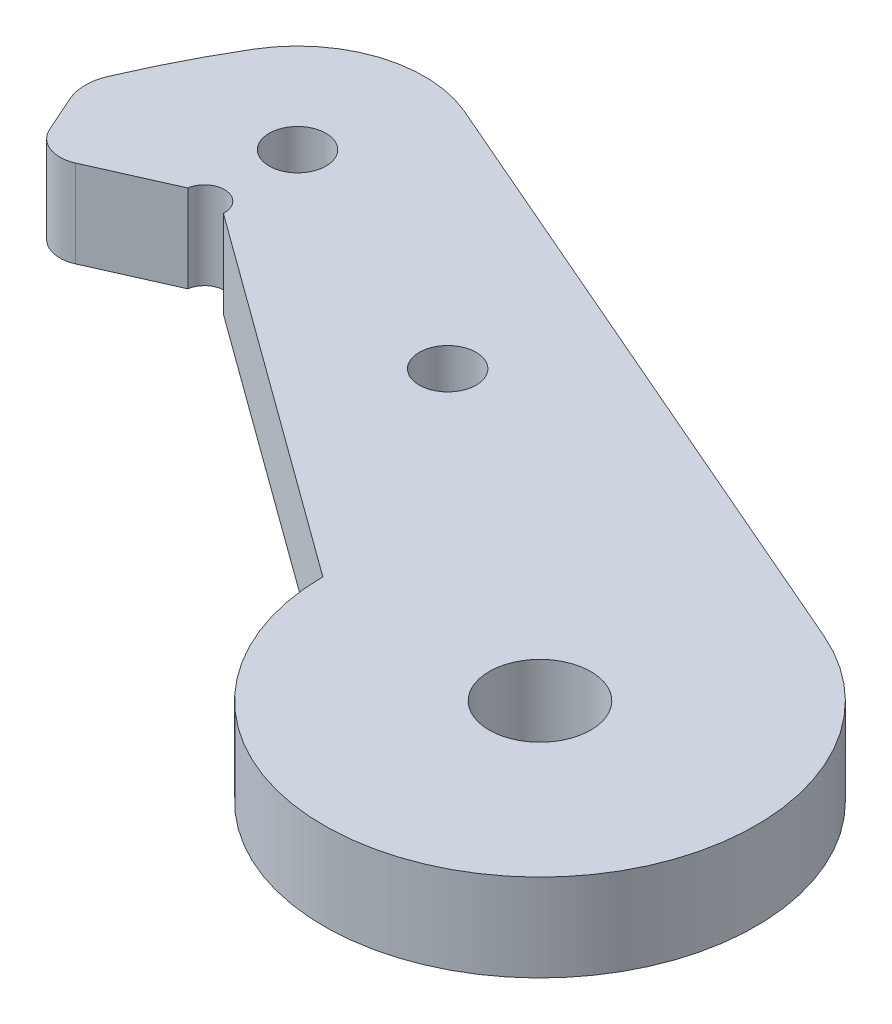
ISO-10303-21;
HEADER;
FILE_DESCRIPTION(('STEP AP214'),'2;1');
FILE_NAME('part.step','',(''),(''),'','','');
FILE_SCHEMA(('AUTOMOTIVE_DESIGN { 1 0 10303 214 1 1 1 1 }'));
ENDSEC;
DATA;
#1=APPLICATION_CONTEXT('core data for automotive mechanical design processes');
#2=APPLICATION_PROTOCOL_DEFINITION('international standard','automotive_design',2000,#1);
#3=PRODUCT_CONTEXT('',#1,'mechanical');
#4=PRODUCT('Part','Part','',(#3));
#5=PRODUCT_RELATED_PRODUCT_CATEGORY('part','',(#4));
#6=PRODUCT_DEFINITION_FORMATION('','',#4);
#7=PRODUCT_DEFINITION_CONTEXT('part definition',#1,'design');
#8=PRODUCT_DEFINITION('design','',#6,#7);
#9=PRODUCT_DEFINITION_SHAPE('','',#8);
#10=(LENGTH_UNIT() NAMED_UNIT(*) SI_UNIT(.MILLI.,.METRE.));
#11=(NAMED_UNIT(*) PLANE_ANGLE_UNIT() SI_UNIT($,.RADIAN.));
#12=(NAMED_UNIT(*) SI_UNIT($,.STERADIAN.) SOLID_ANGLE_UNIT());
#13=UNCERTAINTY_MEASURE_WITH_UNIT(LENGTH_MEASURE(1.E-05),#10,'distance_accuracy_value','');
#14=(GEOMETRIC_REPRESENTATION_CONTEXT(3) GLOBAL_UNCERTAINTY_ASSIGNED_CONTEXT((#13)) GLOBAL_UNIT_ASSIGNED_CONTEXT((#10,
#11,#12)) REPRESENTATION_CONTEXT('',''));
#15=CARTESIAN_POINT('',(0.,0.,0.));
#16=DIRECTION('',(0.,0.,1.));
#17=DIRECTION('',(1.,0.,0.));
#18=AXIS2_PLACEMENT_3D('',#15,#16,#17);
#19=CARTESIAN_POINT('',(-44.4381463641511,5.461,-16.4261833639371));
#20=DIRECTION('',(0.,-1.,0.));
#21=DIRECTION('',(0.,0.,-1.));
#22=AXIS2_PLACEMENT_3D('',#19,#20,#21);
#23=PLANE('',#22);
#24=CARTESIAN_POINT('',(-44.4381463641511,5.461,-16.4261833639371));
#25=DIRECTION('',(0.,1.,0.));
#26=DIRECTION('',(0.,0.,-1.));
#27=AXIS2_PLACEMENT_3D('',#24,#25,#26);
#28=CIRCLE('',#27,2.);
#29=CARTESIAN_POINT('',(-46.2655823530906,5.461,-15.6134855687334));
#30=VERTEX_POINT('',#29);
#31=CARTESIAN_POINT('',(-43.6254485689475,5.461,-14.5987473749976));
#32=VERTEX_POINT('',#31);
#33=EDGE_CURVE('E177',#30,#32,#28,.T.);
#34=ORIENTED_EDGE('',*,*,#33,.T.);
#35=DIRECTION('',(0.913717994469729,0.,-0.406348897601823));
#36=VECTOR('',#35,1.);
#37=CARTESIAN_POINT('',(-38.7702250311405,5.461,-16.7579636147339));
#38=LINE('',#37,#36);
#39=CARTESIAN_POINT('',(-38.7702250311405,5.461,-16.7579636147339));
#40=VERTEX_POINT('',#39);
#41=EDGE_CURVE('E109',#32,#40,#38,.T.);
#42=ORIENTED_EDGE('',*,*,#41,.T.);
#43=CARTESIAN_POINT('',(-37.5347907026087,5.461,-16.5676953307629));
#44=DIRECTION('',(0.,-1.,0.));
#45=DIRECTION('',(0.,0.,-1.));
#46=AXIS2_PLACEMENT_3D('',#43,#44,#45);
#47=CIRCLE('',#46,1.25);
#48=CARTESIAN_POINT('',(-36.2868550805044,5.461,-16.4958852821415));
#49=VERTEX_POINT('',#48);
#50=EDGE_CURVE('E194',#40,#49,#47,.T.);
#51=ORIENTED_EDGE('',*,*,#50,.T.);
#52=DIRECTION('',(0.808767465357847,0.,0.588128546304839));
#53=VECTOR('',#52,1.);
#54=CARTESIAN_POINT('',(-36.2868550805044,5.461,-16.4958852821415));
#55=LINE('',#54,#53);
#56=CARTESIAN_POINT('',(-13.4997935259034,5.461,0.074664301893318));
#57=VERTEX_POINT('',#56);
#58=EDGE_CURVE('E197',#49,#57,#55,.T.);
#59=ORIENTED_EDGE('',*,*,#58,.T.);
#60=CARTESIAN_POINT('',(0.,5.461,0.));
#61=DIRECTION('',(0.,1.,0.));
#62=DIRECTION('',(0.,0.,1.));
#63=AXIS2_PLACEMENT_3D('',#60,#61,#62);
#64=CIRCLE('',#63,13.5);
#65=CARTESIAN_POINT('',(5.36363887672502,5.461,-12.3887601478148));
#66=VERTEX_POINT('',#65);
#67=EDGE_CURVE('E201',#57,#66,#64,.T.);
#68=ORIENTED_EDGE('',*,*,#67,.T.);
#69=DIRECTION('',(-0.917685936875169,0.,-0.397306583461113));
#70=VECTOR('',#69,1.);
#71=CARTESIAN_POINT('',(-34.2596328863461,5.461,-29.5434163293646));
#72=LINE('',#71,#70);
#73=CARTESIAN_POINT('',(-34.2596328863461,5.461,-29.5434163293646));
#74=VERTEX_POINT('',#73);
#75=EDGE_CURVE('E205',#66,#74,#72,.T.);
#76=ORIENTED_EDGE('',*,*,#75,.T.);
#77=CARTESIAN_POINT('',(-37.4132538925687,5.461,-22.2592842054179));
#78=DIRECTION('',(0.,1.,0.));
#79=DIRECTION('',(0.,0.,1.));
#80=AXIS2_PLACEMENT_3D('',#77,#78,#79);
#81=CIRCLE('',#80,7.93750000000001);
#82=CARTESIAN_POINT('',(-44.234733224639,5.461,-26.3177723441387));
#83=VERTEX_POINT('',#82);
#84=EDGE_CURVE('E134',#74,#83,#81,.T.);
#85=ORIENTED_EDGE('',*,*,#84,.T.);
#86=CARTESIAN_POINT('',(0.,5.461,0.));
#87=DIRECTION('',(0.,1.,0.));
#88=DIRECTION('',(0.,0.,-1.));
#89=AXIS2_PLACEMENT_3D('',#86,#87,#88);
#90=CIRCLE('',#89,51.4717083902691);
#91=CARTESIAN_POINT('',(-47.2982832858306,5.461,-20.3029348328316));
#92=VERTEX_POINT('',#91);
#93=EDGE_CURVE('E128',#83,#92,#90,.T.);
#94=ORIENTED_EDGE('',*,*,#93,.T.);
#95=CARTESIAN_POINT('',(-44.5415290553004,5.461,-19.1195895271606));
#96=DIRECTION('',(0.,1.,0.));
#97=DIRECTION('',(0.,0.,1.));
#98=AXIS2_PLACEMENT_3D('',#95,#96,#97);
#99=CIRCLE('',#98,3.);
#100=CARTESIAN_POINT('',(-47.2826830387096,5.461,-17.9005428343551));
#101=VERTEX_POINT('',#100);
#102=EDGE_CURVE('E132',#92,#101,#99,.T.);
#103=ORIENTED_EDGE('',*,*,#102,.T.);
#104=DIRECTION('',(0.406348897601824,0.,0.913717994469728));
#105=VECTOR('',#104,1.);
#106=CARTESIAN_POINT('',(-46.2655823530906,5.461,-15.6134855687334));
#107=LINE('',#106,#105);
#108=EDGE_CURVE('E60',#101,#30,#107,.T.);
#109=ORIENTED_EDGE('',*,*,#108,.T.);
#110=EDGE_LOOP('',(#34,#42,#51,#59,#68,#76,#85,#94,#103,#109));
#111=FACE_BOUND('',#110,.T.);
#112=CARTESIAN_POINT('',(-20.8624589223986,5.461,-15.0937174914343));
#113=DIRECTION('',(0.,1.,0.));
#114=DIRECTION('',(0.,0.,1.));
#115=AXIS2_PLACEMENT_3D('',#112,#113,#114);
#116=CIRCLE('',#115,1.778);
#117=CARTESIAN_POINT('',(-20.8624589223986,5.461,-13.3157174914343));
#118=VERTEX_POINT('',#117);
#119=EDGE_CURVE('E165',#118,#118,#116,.T.);
#120=ORIENTED_EDGE('',*,*,#119,.F.);
#121=EDGE_LOOP('',(#120));
#122=FACE_BOUND('',#121,.T.);
#123=CARTESIAN_POINT('',(0.,5.461,0.));
#124=DIRECTION('',(0.,1.,0.));
#125=DIRECTION('',(0.,0.,1.));
#126=AXIS2_PLACEMENT_3D('',#123,#124,#125);
#127=CIRCLE('',#126,3.175);
#128=CARTESIAN_POINT('',(0.,5.461,3.175));
#129=VERTEX_POINT('',#128);
#130=EDGE_CURVE('E176',#129,#129,#127,.T.);
#131=ORIENTED_EDGE('',*,*,#130,.F.);
#132=EDGE_LOOP('',(#131));
#133=FACE_BOUND('',#132,.T.);
#134=CARTESIAN_POINT('',(-37.4132538925687,5.461,-22.2592842054179));
#135=DIRECTION('',(0.,1.,0.));
#136=DIRECTION('',(0.,0.,1.));
#137=AXIS2_PLACEMENT_3D('',#134,#135,#136);
#138=CIRCLE('',#137,1.778);
#139=CARTESIAN_POINT('',(-37.4132538925687,5.461,-20.4812842054179));
#140=VERTEX_POINT('',#139);
#141=EDGE_CURVE('E404',#140,#140,#138,.T.);
#142=ORIENTED_EDGE('',*,*,#141,.F.);
#143=EDGE_LOOP('',(#142));
#144=FACE_BOUND('',#143,.T.);
#145=ADVANCED_FACE('F43',(#111,#122,#133,#144),#23,.F.);
#146=CARTESIAN_POINT('',(-44.4381463641511,0.,-16.4261833639371));
#147=DIRECTION('',(0.,-1.,0.));
#148=DIRECTION('',(0.,0.,-1.));
#149=AXIS2_PLACEMENT_3D('',#146,#147,#148);
#150=PLANE('',#149);
#151=CARTESIAN_POINT('',(0.,0.,0.));
#152=DIRECTION('',(0.,1.,0.));
#153=DIRECTION('',(0.,0.,1.));
#154=AXIS2_PLACEMENT_3D('',#151,#152,#153);
#155=CIRCLE('',#154,3.175);
#156=CARTESIAN_POINT('',(0.,0.,3.175));
#157=VERTEX_POINT('',#156);
#158=EDGE_CURVE('E173',#157,#157,#155,.T.);
#159=ORIENTED_EDGE('',*,*,#158,.T.);
#160=EDGE_LOOP('',(#159));
#161=FACE_BOUND('',#160,.T.);
#162=CARTESIAN_POINT('',(-44.4381463641511,0.,-16.4261833639371));
#163=DIRECTION('',(0.,1.,0.));
#164=DIRECTION('',(0.,0.,-1.));
#165=AXIS2_PLACEMENT_3D('',#162,#163,#164);
#166=CIRCLE('',#165,2.);
#167=CARTESIAN_POINT('',(-46.2655823530906,0.,-15.6134855687334));
#168=VERTEX_POINT('',#167);
#169=CARTESIAN_POINT('',(-43.6254485689475,0.,-14.5987473749976));
#170=VERTEX_POINT('',#169);
#171=EDGE_CURVE('E171',#168,#170,#166,.T.);
#172=ORIENTED_EDGE('',*,*,#171,.F.);
#173=DIRECTION('',(0.406348897601824,0.,0.913717994469728));
#174=VECTOR('',#173,1.);
#175=CARTESIAN_POINT('',(-46.2655823530906,0.,-15.6134855687334));
#176=LINE('',#175,#174);
#177=CARTESIAN_POINT('',(-47.2826830387096,0.,-17.9005428343551));
#178=VERTEX_POINT('',#177);
#179=EDGE_CURVE('E101',#178,#168,#176,.T.);
#180=ORIENTED_EDGE('',*,*,#179,.F.);
#181=CARTESIAN_POINT('',(-44.5415290553004,0.,-19.1195895271606));
#182=DIRECTION('',(0.,1.,0.));
#183=DIRECTION('',(0.,0.,1.));
#184=AXIS2_PLACEMENT_3D('',#181,#182,#183);
#185=CIRCLE('',#184,3.);
#186=CARTESIAN_POINT('',(-47.2982832858306,0.,-20.3029348328316));
#187=VERTEX_POINT('',#186);
#188=EDGE_CURVE('E95',#187,#178,#185,.T.);
#189=ORIENTED_EDGE('',*,*,#188,.F.);
#190=CARTESIAN_POINT('',(0.,0.,0.));
#191=DIRECTION('',(0.,1.,0.));
#192=DIRECTION('',(0.,0.,-1.));
#193=AXIS2_PLACEMENT_3D('',#190,#191,#192);
#194=CIRCLE('',#193,51.4717083902691);
#195=CARTESIAN_POINT('',(-44.234733224639,0.,-26.3177723441387));
#196=VERTEX_POINT('',#195);
#197=EDGE_CURVE('E143',#196,#187,#194,.T.);
#198=ORIENTED_EDGE('',*,*,#197,.F.);
#199=CARTESIAN_POINT('',(-37.4132538925687,0.,-22.2592842054179));
#200=DIRECTION('',(0.,1.,0.));
#201=DIRECTION('',(0.,0.,1.));
#202=AXIS2_PLACEMENT_3D('',#199,#200,#201);
#203=CIRCLE('',#202,7.93750000000001);
#204=CARTESIAN_POINT('',(-34.2596328863461,0.,-29.5434163293646));
#205=VERTEX_POINT('',#204);
#206=EDGE_CURVE('E227',#205,#196,#203,.T.);
#207=ORIENTED_EDGE('',*,*,#206,.F.);
#208=DIRECTION('',(-0.917685936875169,0.,-0.397306583461113));
#209=VECTOR('',#208,1.);
#210=CARTESIAN_POINT('',(-34.2596328863461,0.,-29.5434163293646));
#211=LINE('',#210,#209);
#212=CARTESIAN_POINT('',(5.36363887672502,0.,-12.3887601478148));
#213=VERTEX_POINT('',#212);
#214=EDGE_CURVE('E221',#213,#205,#211,.T.);
#215=ORIENTED_EDGE('',*,*,#214,.F.);
#216=CARTESIAN_POINT('',(0.,0.,0.));
#217=DIRECTION('',(0.,1.,0.));
#218=DIRECTION('',(0.,0.,1.));
#219=AXIS2_PLACEMENT_3D('',#216,#217,#218);
#220=CIRCLE('',#219,13.5);
#221=CARTESIAN_POINT('',(-13.4997935259034,0.,0.074664301893318));
#222=VERTEX_POINT('',#221);
#223=EDGE_CURVE('E253',#222,#213,#220,.T.);
#224=ORIENTED_EDGE('',*,*,#223,.F.);
#225=DIRECTION('',(0.808767465357847,0.,0.588128546304839));
#226=VECTOR('',#225,1.);
#227=CARTESIAN_POINT('',(-36.2868550805044,0.,-16.4958852821415));
#228=LINE('',#227,#226);
#229=CARTESIAN_POINT('',(-36.2868550805044,0.,-16.4958852821415));
#230=VERTEX_POINT('',#229);
#231=EDGE_CURVE('E251',#230,#222,#228,.T.);
#232=ORIENTED_EDGE('',*,*,#231,.F.);
#233=CARTESIAN_POINT('',(-37.5347907026087,0.,-16.5676953307629));
#234=DIRECTION('',(0.,-1.,0.));
#235=DIRECTION('',(0.,0.,-1.));
#236=AXIS2_PLACEMENT_3D('',#233,#234,#235);
#237=CIRCLE('',#236,1.25);
#238=CARTESIAN_POINT('',(-38.7702250311405,0.,-16.7579636147339));
#239=VERTEX_POINT('',#238);
#240=EDGE_CURVE('E243',#239,#230,#237,.T.);
#241=ORIENTED_EDGE('',*,*,#240,.F.);
#242=DIRECTION('',(0.913717994469729,0.,-0.406348897601823));
#243=VECTOR('',#242,1.);
#244=CARTESIAN_POINT('',(-38.7702250311405,0.,-16.7579636147339));
#245=LINE('',#244,#243);
#246=EDGE_CURVE('E249',#170,#239,#245,.T.);
#247=ORIENTED_EDGE('',*,*,#246,.F.);
#248=EDGE_LOOP('',(#172,#180,#189,#198,#207,#215,#224,#232,#241,#247));
#249=FACE_BOUND('',#248,.T.);
#250=CARTESIAN_POINT('',(-20.8624589223986,0.,-15.0937174914343));
#251=DIRECTION('',(0.,1.,0.));
#252=DIRECTION('',(0.,0.,1.));
#253=AXIS2_PLACEMENT_3D('',#250,#251,#252);
#254=CIRCLE('',#253,1.778);
#255=CARTESIAN_POINT('',(-20.8624589223986,0.,-13.3157174914343));
#256=VERTEX_POINT('',#255);
#257=EDGE_CURVE('E172',#256,#256,#254,.T.);
#258=ORIENTED_EDGE('',*,*,#257,.T.);
#259=EDGE_LOOP('',(#258));
#260=FACE_BOUND('',#259,.T.);
#261=CARTESIAN_POINT('',(-37.4132538925687,0.,-22.2592842054179));
#262=DIRECTION('',(0.,1.,0.));
#263=DIRECTION('',(0.,0.,1.));
#264=AXIS2_PLACEMENT_3D('',#261,#262,#263);
#265=CIRCLE('',#264,1.778);
#266=CARTESIAN_POINT('',(-37.4132538925687,0.,-20.4812842054179));
#267=VERTEX_POINT('',#266);
#268=EDGE_CURVE('E407',#267,#267,#265,.T.);
#269=ORIENTED_EDGE('',*,*,#268,.T.);
#270=EDGE_LOOP('',(#269));
#271=FACE_BOUND('',#270,.T.);
#272=ADVANCED_FACE('F247',(#161,#249,#260,#271),#150,.T.);
#273=CARTESIAN_POINT('',(-44.4381463641511,5.461,-16.4261833639371));
#274=DIRECTION('',(0.,-1.,0.));
#275=DIRECTION('',(0.,0.,-1.));
#276=AXIS2_PLACEMENT_3D('',#273,#274,#275);
#277=CYLINDRICAL_SURFACE('',#276,2.);
#278=ORIENTED_EDGE('',*,*,#171,.T.);
#279=DIRECTION('',(0.,-1.,0.));
#280=VECTOR('',#279,1.);
#281=CARTESIAN_POINT('',(-43.6254485689475,5.461,-14.5987473749976));
#282=LINE('',#281,#280);
#283=EDGE_CURVE('E13',#32,#170,#282,.T.);
#284=ORIENTED_EDGE('',*,*,#283,.F.);
#285=ORIENTED_EDGE('',*,*,#33,.F.);
#286=DIRECTION('',(0.,-1.,0.));
#287=VECTOR('',#286,1.);
#288=CARTESIAN_POINT('',(-46.2655823530906,5.461,-15.6134855687334));
#289=LINE('',#288,#287);
#290=EDGE_CURVE('E151',#30,#168,#289,.T.);
#291=ORIENTED_EDGE('',*,*,#290,.T.);
#292=EDGE_LOOP('',(#278,#284,#285,#291));
#293=FACE_BOUND('',#292,.T.);
#294=ADVANCED_FACE('F45',(#293),#277,.T.);
#295=CARTESIAN_POINT('',(-38.7702250311405,5.461,-16.7579636147339));
#296=DIRECTION('',(-0.406348897601823,0.,-0.913717994469728));
#297=DIRECTION('',(-0.913717994469729,0.,0.406348897601823));
#298=AXIS2_PLACEMENT_3D('',#295,#296,#297);
#299=PLANE('',#298);
#300=ORIENTED_EDGE('',*,*,#246,.T.);
#301=DIRECTION('',(0.,-1.,0.));
#302=VECTOR('',#301,1.);
#303=CARTESIAN_POINT('',(-38.7702250311405,5.461,-16.7579636147339));
#304=LINE('',#303,#302);
#305=EDGE_CURVE('E52',#40,#239,#304,.T.);
#306=ORIENTED_EDGE('',*,*,#305,.F.);
#307=ORIENTED_EDGE('',*,*,#41,.F.);
#308=ORIENTED_EDGE('',*,*,#283,.T.);
#309=EDGE_LOOP('',(#300,#306,#307,#308));
#310=FACE_BOUND('',#309,.T.);
#311=ADVANCED_FACE('F373',(#310),#299,.F.);
#312=CARTESIAN_POINT('',(-37.5347907026087,5.461,-16.5676953307629));
#313=DIRECTION('',(0.,-1.,0.));
#314=DIRECTION('',(0.,0.,-1.));
#315=AXIS2_PLACEMENT_3D('',#312,#313,#314);
#316=CYLINDRICAL_SURFACE('',#315,1.25);
#317=ORIENTED_EDGE('',*,*,#240,.T.);
#318=DIRECTION('',(0.,-1.,0.));
#319=VECTOR('',#318,1.);
#320=CARTESIAN_POINT('',(-36.2868550805044,5.461,-16.4958852821415));
#321=LINE('',#320,#319);
#322=EDGE_CURVE('E235',#49,#230,#321,.T.);
#323=ORIENTED_EDGE('',*,*,#322,.F.);
#324=ORIENTED_EDGE('',*,*,#50,.F.);
#325=ORIENTED_EDGE('',*,*,#305,.T.);
#326=EDGE_LOOP('',(#317,#323,#324,#325));
#327=FACE_BOUND('',#326,.T.);
#328=ADVANCED_FACE('F241',(#327),#316,.F.);
#329=CARTESIAN_POINT('',(-36.2868550805044,5.461,-16.4958852821415));
#330=DIRECTION('',(0.588128546304839,0.,-0.808767465357848));
#331=DIRECTION('',(-0.808767465357848,0.,-0.588128546304839));
#332=AXIS2_PLACEMENT_3D('',#329,#330,#331);
#333=PLANE('',#332);
#334=ORIENTED_EDGE('',*,*,#231,.T.);
#335=DIRECTION('',(0.,-1.,0.));
#336=VECTOR('',#335,1.);
#337=CARTESIAN_POINT('',(-13.4997935259034,5.461,0.074664301893318));
#338=LINE('',#337,#336);
#339=EDGE_CURVE('E232',#57,#222,#338,.T.);
#340=ORIENTED_EDGE('',*,*,#339,.F.);
#341=ORIENTED_EDGE('',*,*,#58,.F.);
#342=ORIENTED_EDGE('',*,*,#322,.T.);
#343=EDGE_LOOP('',(#334,#340,#341,#342));
#344=FACE_BOUND('',#343,.T.);
#345=ADVANCED_FACE('F272',(#344),#333,.F.);
#346=CARTESIAN_POINT('',(0.,5.461,0.));
#347=DIRECTION('',(0.,-1.,0.));
#348=DIRECTION('',(0.,0.,-1.));
#349=AXIS2_PLACEMENT_3D('',#346,#347,#348);
#350=CYLINDRICAL_SURFACE('',#349,13.5);
#351=ORIENTED_EDGE('',*,*,#223,.T.);
#352=DIRECTION('',(0.,-1.,0.));
#353=VECTOR('',#352,1.);
#354=CARTESIAN_POINT('',(5.36363887672502,5.461,-12.3887601478148));
#355=LINE('',#354,#353);
#356=EDGE_CURVE('E224',#66,#213,#355,.T.);
#357=ORIENTED_EDGE('',*,*,#356,.F.);
#358=ORIENTED_EDGE('',*,*,#67,.F.);
#359=ORIENTED_EDGE('',*,*,#339,.T.);
#360=EDGE_LOOP('',(#351,#357,#358,#359));
#361=FACE_BOUND('',#360,.T.);
#362=ADVANCED_FACE('F274',(#361),#350,.T.);
#363=CARTESIAN_POINT('',(-34.2596328863461,5.461,-29.5434163293646));
#364=DIRECTION('',(-0.397306583461113,0.,0.917685936875169));
#365=DIRECTION('',(0.91768593687517,0.,0.397306583461113));
#366=AXIS2_PLACEMENT_3D('',#363,#364,#365);
#367=PLANE('',#366);
#368=ORIENTED_EDGE('',*,*,#214,.T.);
#369=DIRECTION('',(0.,-1.,0.));
#370=VECTOR('',#369,1.);
#371=CARTESIAN_POINT('',(-34.2596328863461,5.461,-29.5434163293646));
#372=LINE('',#371,#370);
#373=EDGE_CURVE('E218',#74,#205,#372,.T.);
#374=ORIENTED_EDGE('',*,*,#373,.F.);
#375=ORIENTED_EDGE('',*,*,#75,.F.);
#376=ORIENTED_EDGE('',*,*,#356,.T.);
#377=EDGE_LOOP('',(#368,#374,#375,#376));
#378=FACE_BOUND('',#377,.T.);
#379=ADVANCED_FACE('F219',(#378),#367,.F.);
#380=CARTESIAN_POINT('',(-37.4132538925687,5.461,-22.2592842054179));
#381=DIRECTION('',(0.,-1.,0.));
#382=DIRECTION('',(0.,0.,-1.));
#383=AXIS2_PLACEMENT_3D('',#380,#381,#382);
#384=CYLINDRICAL_SURFACE('',#383,7.93750000000001);
#385=ORIENTED_EDGE('',*,*,#206,.T.);
#386=DIRECTION('',(0.,-1.,0.));
#387=VECTOR('',#386,1.);
#388=CARTESIAN_POINT('',(-44.234733224639,5.461,-26.3177723441387));
#389=LINE('',#388,#387);
#390=EDGE_CURVE('E144',#83,#196,#389,.T.);
#391=ORIENTED_EDGE('',*,*,#390,.F.);
#392=ORIENTED_EDGE('',*,*,#84,.F.);
#393=ORIENTED_EDGE('',*,*,#373,.T.);
#394=EDGE_LOOP('',(#385,#391,#392,#393));
#395=FACE_BOUND('',#394,.T.);
#396=ADVANCED_FACE('F226',(#395),#384,.T.);
#397=CARTESIAN_POINT('',(0.,5.461,0.));
#398=DIRECTION('',(0.,-1.,0.));
#399=DIRECTION('',(0.,0.,-1.));
#400=AXIS2_PLACEMENT_3D('',#397,#398,#399);
#401=CYLINDRICAL_SURFACE('',#400,51.4717083902691);
#402=ORIENTED_EDGE('',*,*,#197,.T.);
#403=DIRECTION('',(0.,-1.,0.));
#404=VECTOR('',#403,1.);
#405=CARTESIAN_POINT('',(-47.2982832858306,5.461,-20.3029348328316));
#406=LINE('',#405,#404);
#407=EDGE_CURVE('E140',#92,#187,#406,.T.);
#408=ORIENTED_EDGE('',*,*,#407,.F.);
#409=ORIENTED_EDGE('',*,*,#93,.F.);
#410=ORIENTED_EDGE('',*,*,#390,.T.);
#411=EDGE_LOOP('',(#402,#408,#409,#410));
#412=FACE_BOUND('',#411,.T.);
#413=ADVANCED_FACE('F141',(#412),#401,.T.);
#414=CARTESIAN_POINT('',(-44.5415290553004,5.461,-19.1195895271606));
#415=DIRECTION('',(0.,-1.,0.));
#416=DIRECTION('',(0.,0.,-1.));
#417=AXIS2_PLACEMENT_3D('',#414,#415,#416);
#418=CYLINDRICAL_SURFACE('',#417,3.);
#419=ORIENTED_EDGE('',*,*,#188,.T.);
#420=DIRECTION('',(0.,-1.,0.));
#421=VECTOR('',#420,1.);
#422=CARTESIAN_POINT('',(-47.2826830387096,5.461,-17.9005428343551));
#423=LINE('',#422,#421);
#424=EDGE_CURVE('E145',#101,#178,#423,.T.);
#425=ORIENTED_EDGE('',*,*,#424,.F.);
#426=ORIENTED_EDGE('',*,*,#102,.F.);
#427=ORIENTED_EDGE('',*,*,#407,.T.);
#428=EDGE_LOOP('',(#419,#425,#426,#427));
#429=FACE_BOUND('',#428,.T.);
#430=ADVANCED_FACE('F147',(#429),#418,.T.);
#431=CARTESIAN_POINT('',(-46.2655823530906,5.461,-15.6134855687334));
#432=DIRECTION('',(0.913717994469728,0.,-0.406348897601824));
#433=DIRECTION('',(-0.406348897601824,0.,-0.913717994469729));
#434=AXIS2_PLACEMENT_3D('',#431,#432,#433);
#435=PLANE('',#434);
#436=ORIENTED_EDGE('',*,*,#179,.T.);
#437=ORIENTED_EDGE('',*,*,#290,.F.);
#438=ORIENTED_EDGE('',*,*,#108,.F.);
#439=ORIENTED_EDGE('',*,*,#424,.T.);
#440=EDGE_LOOP('',(#436,#437,#438,#439));
#441=FACE_BOUND('',#440,.T.);
#442=ADVANCED_FACE('F263',(#441),#435,.F.);
#443=CARTESIAN_POINT('',(-20.8624589223986,5.461,-15.0937174914343));
#444=DIRECTION('',(0.,-1.,0.));
#445=DIRECTION('',(0.,0.,-1.));
#446=AXIS2_PLACEMENT_3D('',#443,#444,#445);
#447=CYLINDRICAL_SURFACE('',#446,1.778);
#448=ORIENTED_EDGE('',*,*,#119,.T.);
#449=EDGE_LOOP('',(#448));
#450=FACE_BOUND('',#449,.T.);
#451=ORIENTED_EDGE('',*,*,#257,.F.);
#452=EDGE_LOOP('',(#451));
#453=FACE_BOUND('',#452,.T.);
#454=ADVANCED_FACE('F291',(#450,#453),#447,.F.);
#455=CARTESIAN_POINT('',(0.,5.461,0.));
#456=DIRECTION('',(0.,-1.,0.));
#457=DIRECTION('',(0.,0.,-1.));
#458=AXIS2_PLACEMENT_3D('',#455,#456,#457);
#459=CYLINDRICAL_SURFACE('',#458,3.175);
#460=ORIENTED_EDGE('',*,*,#130,.T.);
#461=EDGE_LOOP('',(#460));
#462=FACE_BOUND('',#461,.T.);
#463=ORIENTED_EDGE('',*,*,#158,.F.);
#464=EDGE_LOOP('',(#463));
#465=FACE_BOUND('',#464,.T.);
#466=ADVANCED_FACE('F323',(#462,#465),#459,.F.);
#467=CARTESIAN_POINT('',(-37.4132538925687,5.461,-22.2592842054179));
#468=DIRECTION('',(0.,-1.,0.));
#469=DIRECTION('',(0.,0.,-1.));
#470=AXIS2_PLACEMENT_3D('',#467,#468,#469);
#471=CYLINDRICAL_SURFACE('',#470,1.778);
#472=ORIENTED_EDGE('',*,*,#141,.T.);
#473=EDGE_LOOP('',(#472));
#474=FACE_BOUND('',#473,.T.);
#475=ORIENTED_EDGE('',*,*,#268,.F.);
#476=EDGE_LOOP('',(#475));
#477=FACE_BOUND('',#476,.T.);
#478=ADVANCED_FACE('F330',(#474,#477),#471,.F.);
#479=CLOSED_SHELL('',(#145,#272,#294,#311,#328,#345,#362,#379,#396,#413,#430,#442,#454,#466,#478));
#480=MANIFOLD_SOLID_BREP('B2',#479);
#481=ADVANCED_BREP_SHAPE_REPRESENTATION('',(#18,#480),#14);
#482=SHAPE_DEFINITION_REPRESENTATION(#9,#481);
ENDSEC;
END-ISO-10303-21;
